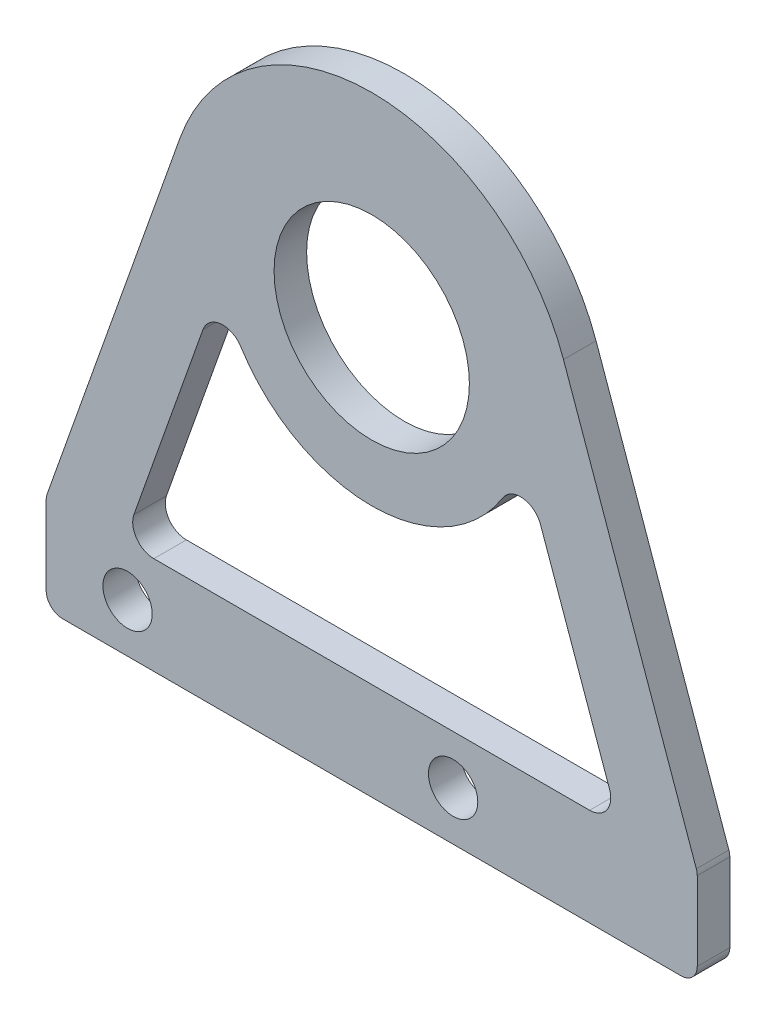
ISO-10303-21;
HEADER;
FILE_DESCRIPTION(('STEP AP214'),'2;1');
FILE_NAME('part.step','',(''),(''),'','','');
FILE_SCHEMA(('AUTOMOTIVE_DESIGN { 1 0 10303 214 1 1 1 1 }'));
ENDSEC;
DATA;
#1=APPLICATION_CONTEXT('core data for automotive mechanical design processes');
#2=APPLICATION_PROTOCOL_DEFINITION('international standard','automotive_design',2000,#1);
#3=PRODUCT_CONTEXT('',#1,'mechanical');
#4=PRODUCT('Part','Part','',(#3));
#5=PRODUCT_RELATED_PRODUCT_CATEGORY('part','',(#4));
#6=PRODUCT_DEFINITION_FORMATION('','',#4);
#7=PRODUCT_DEFINITION_CONTEXT('part definition',#1,'design');
#8=PRODUCT_DEFINITION('design','',#6,#7);
#9=PRODUCT_DEFINITION_SHAPE('','',#8);
#10=(LENGTH_UNIT() NAMED_UNIT(*) SI_UNIT(.MILLI.,.METRE.));
#11=(NAMED_UNIT(*) PLANE_ANGLE_UNIT() SI_UNIT($,.RADIAN.));
#12=(NAMED_UNIT(*) SI_UNIT($,.STERADIAN.) SOLID_ANGLE_UNIT());
#13=UNCERTAINTY_MEASURE_WITH_UNIT(LENGTH_MEASURE(1.E-05),#10,'distance_accuracy_value','');
#14=(GEOMETRIC_REPRESENTATION_CONTEXT(3) GLOBAL_UNCERTAINTY_ASSIGNED_CONTEXT((#13)) GLOBAL_UNIT_ASSIGNED_CONTEXT((#10,
#11,#12)) REPRESENTATION_CONTEXT('',''));
#15=CARTESIAN_POINT('',(0.,0.,0.));
#16=DIRECTION('',(0.,0.,1.));
#17=DIRECTION('',(1.,0.,0.));
#18=AXIS2_PLACEMENT_3D('',#15,#16,#17);
#19=CARTESIAN_POINT('',(0.,0.,2.));
#20=DIRECTION('',(0.,0.,1.));
#21=DIRECTION('',(1.,0.,0.));
#22=AXIS2_PLACEMENT_3D('',#19,#20,#21);
#23=PLANE('',#22);
#24=CARTESIAN_POINT('',(0.,0.,2.));
#25=DIRECTION('',(0.,0.,1.));
#26=DIRECTION('',(1.,0.,0.));
#27=AXIS2_PLACEMENT_3D('',#24,#25,#26);
#28=CIRCLE('',#27,9.5);
#29=CARTESIAN_POINT('',(8.04480674425406,-5.05282935073057,2.));
#30=VERTEX_POINT('',#29);
#31=CARTESIAN_POINT('',(-8.04480674425406,-5.05282935073057,2.));
#32=VERTEX_POINT('',#31);
#33=EDGE_CURVE('E274',#30,#32,#28,.F.);
#34=ORIENTED_EDGE('',*,*,#33,.F.);
#35=CARTESIAN_POINT('',(9.14567503557304,-5.74426915662002,2.));
#36=DIRECTION('',(0.,0.,1.));
#37=DIRECTION('',(1.,0.,0.));
#38=AXIS2_PLACEMENT_3D('',#35,#36,#37);
#39=CIRCLE('',#38,1.3);
#40=CARTESIAN_POINT('',(10.3709235661795,-5.30979701913958,2.));
#41=VERTEX_POINT('',#40);
#42=EDGE_CURVE('E11',#30,#41,#39,.F.);
#43=ORIENTED_EDGE('',*,*,#42,.T.);
#44=DIRECTION('',(-0.334209336523414,0.942498869697243,0.));
#45=VECTOR('',#44,1.);
#46=CARTESIAN_POINT('',(7.53999095757794,2.67367469218731,2.));
#47=LINE('',#46,#45);
#48=CARTESIAN_POINT('',(14.6104160486498,-17.2655278625187,2.));
#49=VERTEX_POINT('',#48);
#50=EDGE_CURVE('E272',#49,#41,#47,.T.);
#51=ORIENTED_EDGE('',*,*,#50,.F.);
#52=CARTESIAN_POINT('',(13.3851675180434,-17.6999999999992,2.));
#53=DIRECTION('',(0.,0.,1.));
#54=DIRECTION('',(1.,0.,0.));
#55=AXIS2_PLACEMENT_3D('',#52,#53,#54);
#56=CIRCLE('',#55,1.3);
#57=CARTESIAN_POINT('',(13.3851675180434,-18.9999999999992,2.));
#58=VERTEX_POINT('',#57);
#59=EDGE_CURVE('E254',#49,#58,#56,.F.);
#60=ORIENTED_EDGE('',*,*,#59,.T.);
#61=DIRECTION('',(1.,0.,0.));
#62=VECTOR('',#61,1.);
#63=CARTESIAN_POINT('',(0.,-18.9999999999992,2.));
#64=LINE('',#63,#62);
#65=CARTESIAN_POINT('',(-13.3851675180434,-18.9999999999992,2.));
#66=VERTEX_POINT('',#65);
#67=EDGE_CURVE('E278',#66,#58,#64,.T.);
#68=ORIENTED_EDGE('',*,*,#67,.F.);
#69=CARTESIAN_POINT('',(-13.3851675180434,-17.6999999999992,2.));
#70=DIRECTION('',(0.,0.,1.));
#71=DIRECTION('',(1.,0.,0.));
#72=AXIS2_PLACEMENT_3D('',#69,#70,#71);
#73=CIRCLE('',#72,1.3);
#74=CARTESIAN_POINT('',(-14.6104160486498,-17.2655278625187,2.));
#75=VERTEX_POINT('',#74);
#76=EDGE_CURVE('E251',#66,#75,#73,.F.);
#77=ORIENTED_EDGE('',*,*,#76,.T.);
#78=DIRECTION('',(-0.334209336523414,-0.942498869697243,0.));
#79=VECTOR('',#78,1.);
#80=CARTESIAN_POINT('',(-7.53999095757793,2.67367469218731,2.));
#81=LINE('',#80,#79);
#82=CARTESIAN_POINT('',(-10.3709235661795,-5.30979701913959,2.));
#83=VERTEX_POINT('',#82);
#84=EDGE_CURVE('E282',#83,#75,#81,.T.);
#85=ORIENTED_EDGE('',*,*,#84,.F.);
#86=CARTESIAN_POINT('',(-9.14567503557304,-5.74426915662002,2.));
#87=DIRECTION('',(0.,0.,1.));
#88=DIRECTION('',(1.,0.,0.));
#89=AXIS2_PLACEMENT_3D('',#86,#87,#88);
#90=CIRCLE('',#89,1.3);
#91=EDGE_CURVE('E247',#83,#32,#90,.F.);
#92=ORIENTED_EDGE('',*,*,#91,.T.);
#93=EDGE_LOOP('',(#34,#43,#51,#60,#68,#77,#85,#92));
#94=FACE_BOUND('',#93,.T.);
#95=CARTESIAN_POINT('',(-14.9999999999999,-21.9999999999991,2.));
#96=DIRECTION('',(0.,0.,1.));
#97=DIRECTION('',(1.,0.,0.));
#98=AXIS2_PLACEMENT_3D('',#95,#96,#97);
#99=CIRCLE('',#98,1.51499999999972);
#100=CARTESIAN_POINT('',(-13.4850000000002,-21.9999999999991,2.));
#101=VERTEX_POINT('',#100);
#102=EDGE_CURVE('E301',#101,#101,#99,.T.);
#103=ORIENTED_EDGE('',*,*,#102,.F.);
#104=EDGE_LOOP('',(#103));
#105=FACE_BOUND('',#104,.T.);
#106=CARTESIAN_POINT('',(5.00000000000007,-21.9999999999992,2.));
#107=DIRECTION('',(0.,0.,1.));
#108=DIRECTION('',(1.,0.,0.));
#109=AXIS2_PLACEMENT_3D('',#106,#107,#108);
#110=CIRCLE('',#109,1.51499999999973);
#111=CARTESIAN_POINT('',(6.5149999999998,-21.9999999999992,2.));
#112=VERTEX_POINT('',#111);
#113=EDGE_CURVE('E296',#112,#112,#110,.T.);
#114=ORIENTED_EDGE('',*,*,#113,.F.);
#115=EDGE_LOOP('',(#114));
#116=FACE_BOUND('',#115,.T.);
#117=DIRECTION('',(0.,-1.,0.));
#118=VECTOR('',#117,1.);
#119=CARTESIAN_POINT('',(-20.,-25.,2.));
#120=LINE('',#119,#118);
#121=CARTESIAN_POINT('',(-20.,-19.1720512386066,2.));
#122=VERTEX_POINT('',#121);
#123=CARTESIAN_POINT('',(-20.,-24.,2.));
#124=VERTEX_POINT('',#123);
#125=EDGE_CURVE('E311',#122,#124,#120,.T.);
#126=ORIENTED_EDGE('',*,*,#125,.T.);
#127=CARTESIAN_POINT('',(-19.,-24.,2.));
#128=DIRECTION('',(0.,0.,1.));
#129=DIRECTION('',(1.,0.,0.));
#130=AXIS2_PLACEMENT_3D('',#127,#128,#129);
#131=CIRCLE('',#130,1.);
#132=CARTESIAN_POINT('',(-19.,-25.,2.));
#133=VERTEX_POINT('',#132);
#134=EDGE_CURVE('E215',#124,#133,#131,.T.);
#135=ORIENTED_EDGE('',*,*,#134,.T.);
#136=DIRECTION('',(1.,0.,0.));
#137=VECTOR('',#136,1.);
#138=CARTESIAN_POINT('',(-20.,-25.,2.));
#139=LINE('',#138,#137);
#140=CARTESIAN_POINT('',(19.,-25.,2.));
#141=VERTEX_POINT('',#140);
#142=EDGE_CURVE('E313',#133,#141,#139,.T.);
#143=ORIENTED_EDGE('',*,*,#142,.T.);
#144=CARTESIAN_POINT('',(19.,-24.,2.));
#145=DIRECTION('',(0.,0.,1.));
#146=DIRECTION('',(1.,0.,0.));
#147=AXIS2_PLACEMENT_3D('',#144,#145,#146);
#148=CIRCLE('',#147,1.);
#149=CARTESIAN_POINT('',(20.,-24.,2.));
#150=VERTEX_POINT('',#149);
#151=EDGE_CURVE('E210',#141,#150,#148,.T.);
#152=ORIENTED_EDGE('',*,*,#151,.T.);
#153=DIRECTION('',(0.,1.,0.));
#154=VECTOR('',#153,1.);
#155=CARTESIAN_POINT('',(20.,-25.,2.));
#156=LINE('',#155,#154);
#157=CARTESIAN_POINT('',(20.,-19.1720512386066,2.));
#158=VERTEX_POINT('',#157);
#159=EDGE_CURVE('E191',#150,#158,#156,.T.);
#160=ORIENTED_EDGE('',*,*,#159,.T.);
#161=CARTESIAN_POINT('',(19.,-19.1720512386066,2.));
#162=DIRECTION('',(0.,0.,1.));
#163=DIRECTION('',(1.,0.,0.));
#164=AXIS2_PLACEMENT_3D('',#161,#162,#163);
#165=CIRCLE('',#164,1.);
#166=CARTESIAN_POINT('',(19.9424988696972,-18.8378419020832,2.));
#167=VERTEX_POINT('',#166);
#168=EDGE_CURVE('E167',#158,#167,#165,.T.);
#169=ORIENTED_EDGE('',*,*,#168,.T.);
#170=DIRECTION('',(-0.334209336523414,0.942498869697242,0.));
#171=VECTOR('',#170,1.);
#172=CARTESIAN_POINT('',(20.,-19.,2.));
#173=LINE('',#172,#171);
#174=CARTESIAN_POINT('',(11.7812358712155,4.17761670654267,2.));
#175=VERTEX_POINT('',#174);
#176=EDGE_CURVE('E158',#167,#175,#173,.T.);
#177=ORIENTED_EDGE('',*,*,#176,.T.);
#178=CARTESIAN_POINT('',(0.,0.,2.));
#179=DIRECTION('',(0.,0.,1.));
#180=DIRECTION('',(1.,0.,0.));
#181=AXIS2_PLACEMENT_3D('',#178,#179,#180);
#182=CIRCLE('',#181,12.5);
#183=CARTESIAN_POINT('',(-11.7812358712155,4.17761670654266,2.));
#184=VERTEX_POINT('',#183);
#185=EDGE_CURVE('E163',#175,#184,#182,.T.);
#186=ORIENTED_EDGE('',*,*,#185,.T.);
#187=DIRECTION('',(-0.334209336523414,-0.942498869697243,0.));
#188=VECTOR('',#187,1.);
#189=CARTESIAN_POINT('',(-20.,-19.,2.));
#190=LINE('',#189,#188);
#191=CARTESIAN_POINT('',(-19.9424988696972,-18.8378419020832,2.));
#192=VERTEX_POINT('',#191);
#193=EDGE_CURVE('E181',#184,#192,#190,.T.);
#194=ORIENTED_EDGE('',*,*,#193,.T.);
#195=CARTESIAN_POINT('',(-19.,-19.1720512386066,2.));
#196=DIRECTION('',(0.,0.,1.));
#197=DIRECTION('',(1.,0.,0.));
#198=AXIS2_PLACEMENT_3D('',#195,#196,#197);
#199=CIRCLE('',#198,1.);
#200=EDGE_CURVE('E213',#192,#122,#199,.T.);
#201=ORIENTED_EDGE('',*,*,#200,.T.);
#202=EDGE_LOOP('',(#126,#135,#143,#152,#160,#169,#177,#186,#194,#201));
#203=FACE_BOUND('',#202,.T.);
#204=CARTESIAN_POINT('',(0.,0.,2.));
#205=DIRECTION('',(0.,0.,1.));
#206=DIRECTION('',(1.,0.,0.));
#207=AXIS2_PLACEMENT_3D('',#204,#205,#206);
#208=CIRCLE('',#207,6.);
#209=CARTESIAN_POINT('',(6.,0.,2.));
#210=VERTEX_POINT('',#209);
#211=EDGE_CURVE('E305',#210,#210,#208,.T.);
#212=ORIENTED_EDGE('',*,*,#211,.F.);
#213=EDGE_LOOP('',(#212));
#214=FACE_BOUND('',#213,.T.);
#215=ADVANCED_FACE('F34',(#94,#105,#116,#203,#214),#23,.T.);
#216=CARTESIAN_POINT('',(0.,0.,0.));
#217=DIRECTION('',(0.,0.,1.));
#218=DIRECTION('',(1.,0.,0.));
#219=AXIS2_PLACEMENT_3D('',#216,#217,#218);
#220=PLANE('',#219);
#221=DIRECTION('',(0.334209336523414,-0.942498869697243,0.));
#222=VECTOR('',#221,1.);
#223=CARTESIAN_POINT('',(9.25230426601766,-2.15519506519281,0.));
#224=LINE('',#223,#222);
#225=CARTESIAN_POINT('',(10.3709235661795,-5.30979701913958,0.));
#226=VERTEX_POINT('',#225);
#227=CARTESIAN_POINT('',(14.6104160486498,-17.2655278625187,0.));
#228=VERTEX_POINT('',#227);
#229=EDGE_CURVE('E260',#226,#228,#224,.T.);
#230=ORIENTED_EDGE('',*,*,#229,.F.);
#231=CARTESIAN_POINT('',(9.14567503557304,-5.74426915662002,0.));
#232=DIRECTION('',(0.,0.,1.));
#233=DIRECTION('',(1.,0.,0.));
#234=AXIS2_PLACEMENT_3D('',#231,#232,#233);
#235=CIRCLE('',#234,1.3);
#236=CARTESIAN_POINT('',(8.04480674425406,-5.05282935073057,0.));
#237=VERTEX_POINT('',#236);
#238=EDGE_CURVE('E42',#226,#237,#235,.T.);
#239=ORIENTED_EDGE('',*,*,#238,.T.);
#240=CARTESIAN_POINT('',(0.,0.,0.));
#241=DIRECTION('',(0.,0.,1.));
#242=DIRECTION('',(-1.,0.,0.));
#243=AXIS2_PLACEMENT_3D('',#240,#241,#242);
#244=CIRCLE('',#243,9.5);
#245=CARTESIAN_POINT('',(-8.04480674425406,-5.05282935073057,0.));
#246=VERTEX_POINT('',#245);
#247=EDGE_CURVE('E259',#246,#237,#244,.T.);
#248=ORIENTED_EDGE('',*,*,#247,.F.);
#249=CARTESIAN_POINT('',(-9.14567503557304,-5.74426915662002,0.));
#250=DIRECTION('',(0.,0.,1.));
#251=DIRECTION('',(1.,0.,0.));
#252=AXIS2_PLACEMENT_3D('',#249,#250,#251);
#253=CIRCLE('',#252,1.3);
#254=CARTESIAN_POINT('',(-10.3709235661795,-5.30979701913958,0.));
#255=VERTEX_POINT('',#254);
#256=EDGE_CURVE('E245',#246,#255,#253,.T.);
#257=ORIENTED_EDGE('',*,*,#256,.T.);
#258=DIRECTION('',(0.334209336523414,0.942498869697243,0.));
#259=VECTOR('',#258,1.);
#260=CARTESIAN_POINT('',(-15.2254584650634,-18.9999999999992,0.));
#261=LINE('',#260,#259);
#262=CARTESIAN_POINT('',(-14.6104160486498,-17.2655278625187,0.));
#263=VERTEX_POINT('',#262);
#264=EDGE_CURVE('E279',#263,#255,#261,.T.);
#265=ORIENTED_EDGE('',*,*,#264,.F.);
#266=CARTESIAN_POINT('',(-13.3851675180434,-17.6999999999992,0.));
#267=DIRECTION('',(0.,0.,1.));
#268=DIRECTION('',(1.,0.,0.));
#269=AXIS2_PLACEMENT_3D('',#266,#267,#268);
#270=CIRCLE('',#269,1.3);
#271=CARTESIAN_POINT('',(-13.3851675180434,-18.9999999999992,0.));
#272=VERTEX_POINT('',#271);
#273=EDGE_CURVE('E249',#263,#272,#270,.T.);
#274=ORIENTED_EDGE('',*,*,#273,.T.);
#275=DIRECTION('',(-1.,0.,0.));
#276=VECTOR('',#275,1.);
#277=CARTESIAN_POINT('',(15.2254584650634,-18.9999999999992,0.));
#278=LINE('',#277,#276);
#279=CARTESIAN_POINT('',(13.3851675180434,-18.9999999999992,0.));
#280=VERTEX_POINT('',#279);
#281=EDGE_CURVE('E285',#280,#272,#278,.T.);
#282=ORIENTED_EDGE('',*,*,#281,.F.);
#283=CARTESIAN_POINT('',(13.3851675180434,-17.6999999999992,0.));
#284=DIRECTION('',(0.,0.,1.));
#285=DIRECTION('',(1.,0.,0.));
#286=AXIS2_PLACEMENT_3D('',#283,#284,#285);
#287=CIRCLE('',#286,1.3);
#288=EDGE_CURVE('E49',#280,#228,#287,.T.);
#289=ORIENTED_EDGE('',*,*,#288,.T.);
#290=EDGE_LOOP('',(#230,#239,#248,#257,#265,#274,#282,#289));
#291=FACE_BOUND('',#290,.T.);
#292=CARTESIAN_POINT('',(-14.9999999999999,-21.9999999999991,0.));
#293=DIRECTION('',(0.,0.,-1.));
#294=DIRECTION('',(-1.,0.,0.));
#295=AXIS2_PLACEMENT_3D('',#292,#293,#294);
#296=CIRCLE('',#295,1.51499999999972);
#297=CARTESIAN_POINT('',(-16.5149999999996,-21.9999999999991,0.));
#298=VERTEX_POINT('',#297);
#299=EDGE_CURVE('E293',#298,#298,#296,.T.);
#300=ORIENTED_EDGE('',*,*,#299,.F.);
#301=EDGE_LOOP('',(#300));
#302=FACE_BOUND('',#301,.T.);
#303=CARTESIAN_POINT('',(5.00000000000007,-21.9999999999992,0.));
#304=DIRECTION('',(0.,0.,-1.));
#305=DIRECTION('',(-1.,0.,0.));
#306=AXIS2_PLACEMENT_3D('',#303,#304,#305);
#307=CIRCLE('',#306,1.51499999999973);
#308=CARTESIAN_POINT('',(3.48500000000033,-21.9999999999992,0.));
#309=VERTEX_POINT('',#308);
#310=EDGE_CURVE('E292',#309,#309,#307,.T.);
#311=ORIENTED_EDGE('',*,*,#310,.F.);
#312=EDGE_LOOP('',(#311));
#313=FACE_BOUND('',#312,.T.);
#314=DIRECTION('',(1.,0.,0.));
#315=VECTOR('',#314,1.);
#316=CARTESIAN_POINT('',(-20.,-25.,0.));
#317=LINE('',#316,#315);
#318=CARTESIAN_POINT('',(-19.,-25.,0.));
#319=VERTEX_POINT('',#318);
#320=CARTESIAN_POINT('',(19.,-25.,0.));
#321=VERTEX_POINT('',#320);
#322=EDGE_CURVE('E326',#319,#321,#317,.T.);
#323=ORIENTED_EDGE('',*,*,#322,.F.);
#324=CARTESIAN_POINT('',(-19.,-24.,0.));
#325=DIRECTION('',(0.,0.,1.));
#326=DIRECTION('',(1.,0.,0.));
#327=AXIS2_PLACEMENT_3D('',#324,#325,#326);
#328=CIRCLE('',#327,1.);
#329=CARTESIAN_POINT('',(-20.,-24.,0.));
#330=VERTEX_POINT('',#329);
#331=EDGE_CURVE('E203',#319,#330,#328,.F.);
#332=ORIENTED_EDGE('',*,*,#331,.T.);
#333=DIRECTION('',(0.,-1.,0.));
#334=VECTOR('',#333,1.);
#335=CARTESIAN_POINT('',(-20.,-25.,0.));
#336=LINE('',#335,#334);
#337=CARTESIAN_POINT('',(-20.,-19.1720512386066,0.));
#338=VERTEX_POINT('',#337);
#339=EDGE_CURVE('E323',#338,#330,#336,.T.);
#340=ORIENTED_EDGE('',*,*,#339,.F.);
#341=CARTESIAN_POINT('',(-19.,-19.1720512386066,0.));
#342=DIRECTION('',(0.,0.,1.));
#343=DIRECTION('',(1.,0.,0.));
#344=AXIS2_PLACEMENT_3D('',#341,#342,#343);
#345=CIRCLE('',#344,1.);
#346=CARTESIAN_POINT('',(-19.9424988696972,-18.8378419020832,0.));
#347=VERTEX_POINT('',#346);
#348=EDGE_CURVE('E201',#338,#347,#345,.F.);
#349=ORIENTED_EDGE('',*,*,#348,.T.);
#350=DIRECTION('',(-0.334209336523414,-0.942498869697243,0.));
#351=VECTOR('',#350,1.);
#352=CARTESIAN_POINT('',(-20.,-19.,0.));
#353=LINE('',#352,#351);
#354=CARTESIAN_POINT('',(-11.7812358712155,4.17761670654266,0.));
#355=VERTEX_POINT('',#354);
#356=EDGE_CURVE('E320',#355,#347,#353,.T.);
#357=ORIENTED_EDGE('',*,*,#356,.F.);
#358=CARTESIAN_POINT('',(0.,0.,0.));
#359=DIRECTION('',(0.,0.,1.));
#360=DIRECTION('',(1.,0.,0.));
#361=AXIS2_PLACEMENT_3D('',#358,#359,#360);
#362=CIRCLE('',#361,12.5);
#363=CARTESIAN_POINT('',(11.7812358712155,4.17761670654267,0.));
#364=VERTEX_POINT('',#363);
#365=EDGE_CURVE('E318',#364,#355,#362,.T.);
#366=ORIENTED_EDGE('',*,*,#365,.F.);
#367=DIRECTION('',(-0.334209336523414,0.942498869697242,0.));
#368=VECTOR('',#367,1.);
#369=CARTESIAN_POINT('',(20.,-19.,0.));
#370=LINE('',#369,#368);
#371=CARTESIAN_POINT('',(19.9424988696972,-18.8378419020832,0.));
#372=VERTEX_POINT('',#371);
#373=EDGE_CURVE('E185',#372,#364,#370,.T.);
#374=ORIENTED_EDGE('',*,*,#373,.F.);
#375=CARTESIAN_POINT('',(19.,-19.1720512386066,0.));
#376=DIRECTION('',(0.,0.,1.));
#377=DIRECTION('',(1.,0.,0.));
#378=AXIS2_PLACEMENT_3D('',#375,#376,#377);
#379=CIRCLE('',#378,1.);
#380=CARTESIAN_POINT('',(20.,-19.1720512386066,0.));
#381=VERTEX_POINT('',#380);
#382=EDGE_CURVE('E199',#372,#381,#379,.F.);
#383=ORIENTED_EDGE('',*,*,#382,.T.);
#384=DIRECTION('',(0.,1.,0.));
#385=VECTOR('',#384,1.);
#386=CARTESIAN_POINT('',(20.,-25.,0.));
#387=LINE('',#386,#385);
#388=CARTESIAN_POINT('',(20.,-24.,0.));
#389=VERTEX_POINT('',#388);
#390=EDGE_CURVE('E172',#389,#381,#387,.T.);
#391=ORIENTED_EDGE('',*,*,#390,.F.);
#392=CARTESIAN_POINT('',(19.,-24.,0.));
#393=DIRECTION('',(0.,0.,1.));
#394=DIRECTION('',(1.,0.,0.));
#395=AXIS2_PLACEMENT_3D('',#392,#393,#394);
#396=CIRCLE('',#395,1.);
#397=EDGE_CURVE('E197',#389,#321,#396,.F.);
#398=ORIENTED_EDGE('',*,*,#397,.T.);
#399=EDGE_LOOP('',(#323,#332,#340,#349,#357,#366,#374,#383,#391,#398));
#400=FACE_BOUND('',#399,.T.);
#401=CARTESIAN_POINT('',(0.,0.,0.));
#402=DIRECTION('',(0.,0.,1.));
#403=DIRECTION('',(1.,0.,0.));
#404=AXIS2_PLACEMENT_3D('',#401,#402,#403);
#405=CIRCLE('',#404,6.);
#406=CARTESIAN_POINT('',(6.,0.,0.));
#407=VERTEX_POINT('',#406);
#408=EDGE_CURVE('E304',#407,#407,#405,.T.);
#409=ORIENTED_EDGE('',*,*,#408,.T.);
#410=EDGE_LOOP('',(#409));
#411=FACE_BOUND('',#410,.T.);
#412=ADVANCED_FACE('F257',(#291,#302,#313,#400,#411),#220,.F.);
#413=CARTESIAN_POINT('',(20.,-19.,2.));
#414=DIRECTION('',(-0.942498869697242,-0.334209336523414,0.));
#415=DIRECTION('',(0.334209336523414,-0.942498869697242,0.));
#416=AXIS2_PLACEMENT_3D('',#413,#414,#415);
#417=PLANE('',#416);
#418=ORIENTED_EDGE('',*,*,#176,.F.);
#419=DIRECTION('',(0.,0.,-1.));
#420=VECTOR('',#419,1.);
#421=CARTESIAN_POINT('',(19.9424988696972,-18.8378419020832,2.));
#422=LINE('',#421,#420);
#423=EDGE_CURVE('E219',#167,#372,#422,.T.);
#424=ORIENTED_EDGE('',*,*,#423,.T.);
#425=ORIENTED_EDGE('',*,*,#373,.T.);
#426=DIRECTION('',(0.,0.,-1.));
#427=VECTOR('',#426,1.);
#428=CARTESIAN_POINT('',(11.7812358712155,4.17761670654267,2.));
#429=LINE('',#428,#427);
#430=EDGE_CURVE('E177',#175,#364,#429,.T.);
#431=ORIENTED_EDGE('',*,*,#430,.F.);
#432=EDGE_LOOP('',(#418,#424,#425,#431));
#433=FACE_BOUND('',#432,.T.);
#434=ADVANCED_FACE('F183',(#433),#417,.F.);
#435=CARTESIAN_POINT('',(0.,0.,2.));
#436=DIRECTION('',(0.,0.,-1.));
#437=DIRECTION('',(-1.,0.,0.));
#438=AXIS2_PLACEMENT_3D('',#435,#436,#437);
#439=CYLINDRICAL_SURFACE('',#438,12.5);
#440=ORIENTED_EDGE('',*,*,#365,.T.);
#441=DIRECTION('',(0.,0.,-1.));
#442=VECTOR('',#441,1.);
#443=CARTESIAN_POINT('',(-11.7812358712155,4.17761670654266,2.));
#444=LINE('',#443,#442);
#445=EDGE_CURVE('E179',#184,#355,#444,.T.);
#446=ORIENTED_EDGE('',*,*,#445,.F.);
#447=ORIENTED_EDGE('',*,*,#185,.F.);
#448=ORIENTED_EDGE('',*,*,#430,.T.);
#449=EDGE_LOOP('',(#440,#446,#447,#448));
#450=FACE_BOUND('',#449,.T.);
#451=ADVANCED_FACE('F176',(#450),#439,.T.);
#452=CARTESIAN_POINT('',(-20.,-19.,2.));
#453=DIRECTION('',(0.942498869697243,-0.334209336523414,0.));
#454=DIRECTION('',(0.334209336523414,0.942498869697243,0.));
#455=AXIS2_PLACEMENT_3D('',#452,#453,#454);
#456=PLANE('',#455);
#457=ORIENTED_EDGE('',*,*,#356,.T.);
#458=DIRECTION('',(0.,0.,-1.));
#459=VECTOR('',#458,1.);
#460=CARTESIAN_POINT('',(-19.9424988696972,-18.8378419020832,2.));
#461=LINE('',#460,#459);
#462=EDGE_CURVE('E217',#347,#192,#461,.F.);
#463=ORIENTED_EDGE('',*,*,#462,.T.);
#464=ORIENTED_EDGE('',*,*,#193,.F.);
#465=ORIENTED_EDGE('',*,*,#445,.T.);
#466=EDGE_LOOP('',(#457,#463,#464,#465));
#467=FACE_BOUND('',#466,.T.);
#468=ADVANCED_FACE('F342',(#467),#456,.F.);
#469=CARTESIAN_POINT('',(-20.,-25.,2.));
#470=DIRECTION('',(1.,0.,0.));
#471=DIRECTION('',(0.,0.,-1.));
#472=AXIS2_PLACEMENT_3D('',#469,#470,#471);
#473=PLANE('',#472);
#474=ORIENTED_EDGE('',*,*,#339,.T.);
#475=DIRECTION('',(0.,0.,-1.));
#476=VECTOR('',#475,1.);
#477=CARTESIAN_POINT('',(-20.,-24.,2.));
#478=LINE('',#477,#476);
#479=EDGE_CURVE('E208',#330,#124,#478,.F.);
#480=ORIENTED_EDGE('',*,*,#479,.T.);
#481=ORIENTED_EDGE('',*,*,#125,.F.);
#482=DIRECTION('',(0.,0.,-1.));
#483=VECTOR('',#482,1.);
#484=CARTESIAN_POINT('',(-20.,-19.1720512386066,2.));
#485=LINE('',#484,#483);
#486=EDGE_CURVE('E205',#122,#338,#485,.T.);
#487=ORIENTED_EDGE('',*,*,#486,.T.);
#488=EDGE_LOOP('',(#474,#480,#481,#487));
#489=FACE_BOUND('',#488,.T.);
#490=ADVANCED_FACE('F351',(#489),#473,.F.);
#491=CARTESIAN_POINT('',(-20.,-25.,2.));
#492=DIRECTION('',(0.,1.,0.));
#493=DIRECTION('',(-1.,0.,0.));
#494=AXIS2_PLACEMENT_3D('',#491,#492,#493);
#495=PLANE('',#494);
#496=ORIENTED_EDGE('',*,*,#142,.F.);
#497=DIRECTION('',(0.,0.,-1.));
#498=VECTOR('',#497,1.);
#499=CARTESIAN_POINT('',(-19.,-25.,2.));
#500=LINE('',#499,#498);
#501=EDGE_CURVE('E189',#133,#319,#500,.T.);
#502=ORIENTED_EDGE('',*,*,#501,.T.);
#503=ORIENTED_EDGE('',*,*,#322,.T.);
#504=DIRECTION('',(0.,0.,-1.));
#505=VECTOR('',#504,1.);
#506=CARTESIAN_POINT('',(19.,-25.,2.));
#507=LINE('',#506,#505);
#508=EDGE_CURVE('E187',#321,#141,#507,.F.);
#509=ORIENTED_EDGE('',*,*,#508,.T.);
#510=EDGE_LOOP('',(#496,#502,#503,#509));
#511=FACE_BOUND('',#510,.T.);
#512=ADVANCED_FACE('F359',(#511),#495,.F.);
#513=CARTESIAN_POINT('',(20.,-25.,2.));
#514=DIRECTION('',(-1.,0.,0.));
#515=DIRECTION('',(0.,0.,1.));
#516=AXIS2_PLACEMENT_3D('',#513,#514,#515);
#517=PLANE('',#516);
#518=ORIENTED_EDGE('',*,*,#390,.T.);
#519=DIRECTION('',(0.,0.,-1.));
#520=VECTOR('',#519,1.);
#521=CARTESIAN_POINT('',(20.,-19.1720512386066,2.));
#522=LINE('',#521,#520);
#523=EDGE_CURVE('E224',#381,#158,#522,.F.);
#524=ORIENTED_EDGE('',*,*,#523,.T.);
#525=ORIENTED_EDGE('',*,*,#159,.F.);
#526=DIRECTION('',(0.,0.,-1.));
#527=VECTOR('',#526,1.);
#528=CARTESIAN_POINT('',(20.,-24.,2.));
#529=LINE('',#528,#527);
#530=EDGE_CURVE('E221',#150,#389,#529,.T.);
#531=ORIENTED_EDGE('',*,*,#530,.T.);
#532=EDGE_LOOP('',(#518,#524,#525,#531));
#533=FACE_BOUND('',#532,.T.);
#534=ADVANCED_FACE('F332',(#533),#517,.F.);
#535=CARTESIAN_POINT('',(0.,0.,2.));
#536=DIRECTION('',(0.,0.,-1.));
#537=DIRECTION('',(-1.,0.,0.));
#538=AXIS2_PLACEMENT_3D('',#535,#536,#537);
#539=CYLINDRICAL_SURFACE('',#538,6.);
#540=ORIENTED_EDGE('',*,*,#211,.T.);
#541=EDGE_LOOP('',(#540));
#542=FACE_BOUND('',#541,.T.);
#543=ORIENTED_EDGE('',*,*,#408,.F.);
#544=EDGE_LOOP('',(#543));
#545=FACE_BOUND('',#544,.T.);
#546=ADVANCED_FACE('F383',(#542,#545),#539,.F.);
#547=CARTESIAN_POINT('',(-19.,-24.,2.));
#548=DIRECTION('',(0.,0.,-1.));
#549=DIRECTION('',(-1.,0.,0.));
#550=AXIS2_PLACEMENT_3D('',#547,#548,#549);
#551=CYLINDRICAL_SURFACE('',#550,1.);
#552=ORIENTED_EDGE('',*,*,#134,.F.);
#553=ORIENTED_EDGE('',*,*,#479,.F.);
#554=ORIENTED_EDGE('',*,*,#331,.F.);
#555=ORIENTED_EDGE('',*,*,#501,.F.);
#556=EDGE_LOOP('',(#552,#553,#554,#555));
#557=FACE_BOUND('',#556,.T.);
#558=ADVANCED_FACE('F356',(#557),#551,.T.);
#559=CARTESIAN_POINT('',(-19.,-19.1720512386066,2.));
#560=DIRECTION('',(0.,0.,-1.));
#561=DIRECTION('',(-1.,0.,0.));
#562=AXIS2_PLACEMENT_3D('',#559,#560,#561);
#563=CYLINDRICAL_SURFACE('',#562,1.);
#564=ORIENTED_EDGE('',*,*,#200,.F.);
#565=ORIENTED_EDGE('',*,*,#462,.F.);
#566=ORIENTED_EDGE('',*,*,#348,.F.);
#567=ORIENTED_EDGE('',*,*,#486,.F.);
#568=EDGE_LOOP('',(#564,#565,#566,#567));
#569=FACE_BOUND('',#568,.T.);
#570=ADVANCED_FACE('F348',(#569),#563,.T.);
#571=CARTESIAN_POINT('',(19.,-19.1720512386066,2.));
#572=DIRECTION('',(0.,0.,-1.));
#573=DIRECTION('',(-1.,0.,0.));
#574=AXIS2_PLACEMENT_3D('',#571,#572,#573);
#575=CYLINDRICAL_SURFACE('',#574,1.);
#576=ORIENTED_EDGE('',*,*,#168,.F.);
#577=ORIENTED_EDGE('',*,*,#523,.F.);
#578=ORIENTED_EDGE('',*,*,#382,.F.);
#579=ORIENTED_EDGE('',*,*,#423,.F.);
#580=EDGE_LOOP('',(#576,#577,#578,#579));
#581=FACE_BOUND('',#580,.T.);
#582=ADVANCED_FACE('F337',(#581),#575,.T.);
#583=CARTESIAN_POINT('',(19.,-24.,2.));
#584=DIRECTION('',(0.,0.,-1.));
#585=DIRECTION('',(-1.,0.,0.));
#586=AXIS2_PLACEMENT_3D('',#583,#584,#585);
#587=CYLINDRICAL_SURFACE('',#586,1.);
#588=ORIENTED_EDGE('',*,*,#151,.F.);
#589=ORIENTED_EDGE('',*,*,#508,.F.);
#590=ORIENTED_EDGE('',*,*,#397,.F.);
#591=ORIENTED_EDGE('',*,*,#530,.F.);
#592=EDGE_LOOP('',(#588,#589,#590,#591));
#593=FACE_BOUND('',#592,.T.);
#594=ADVANCED_FACE('F363',(#593),#587,.T.);
#595=CARTESIAN_POINT('',(5.00000000000007,-21.9999999999992,10.));
#596=DIRECTION('',(0.,0.,-1.));
#597=DIRECTION('',(-1.,0.,0.));
#598=AXIS2_PLACEMENT_3D('',#595,#596,#597);
#599=CYLINDRICAL_SURFACE('',#598,1.51499999999973);
#600=ORIENTED_EDGE('',*,*,#113,.T.);
#601=EDGE_LOOP('',(#600));
#602=FACE_BOUND('',#601,.T.);
#603=ORIENTED_EDGE('',*,*,#310,.T.);
#604=EDGE_LOOP('',(#603));
#605=FACE_BOUND('',#604,.T.);
#606=ADVANCED_FACE('F365',(#602,#605),#599,.F.);
#607=CARTESIAN_POINT('',(-14.9999999999999,-21.9999999999991,10.));
#608=DIRECTION('',(0.,0.,-1.));
#609=DIRECTION('',(-1.,0.,0.));
#610=AXIS2_PLACEMENT_3D('',#607,#608,#609);
#611=CYLINDRICAL_SURFACE('',#610,1.51499999999972);
#612=ORIENTED_EDGE('',*,*,#102,.T.);
#613=EDGE_LOOP('',(#612));
#614=FACE_BOUND('',#613,.T.);
#615=ORIENTED_EDGE('',*,*,#299,.T.);
#616=EDGE_LOOP('',(#615));
#617=FACE_BOUND('',#616,.T.);
#618=ADVANCED_FACE('F371',(#614,#617),#611,.F.);
#619=CARTESIAN_POINT('',(0.,0.,10.));
#620=DIRECTION('',(0.,0.,-1.));
#621=DIRECTION('',(-1.,0.,0.));
#622=AXIS2_PLACEMENT_3D('',#619,#620,#621);
#623=CYLINDRICAL_SURFACE('',#622,9.5);
#624=ORIENTED_EDGE('',*,*,#33,.T.);
#625=DIRECTION('',(0.,0.,-1.));
#626=VECTOR('',#625,1.);
#627=CARTESIAN_POINT('',(-8.04480674425406,-5.05282935073057,10.));
#628=LINE('',#627,#626);
#629=EDGE_CURVE('E228',#32,#246,#628,.T.);
#630=ORIENTED_EDGE('',*,*,#629,.T.);
#631=ORIENTED_EDGE('',*,*,#247,.T.);
#632=DIRECTION('',(0.,0.,-1.));
#633=VECTOR('',#632,1.);
#634=CARTESIAN_POINT('',(8.04480674425406,-5.05282935073057,10.));
#635=LINE('',#634,#633);
#636=EDGE_CURVE('E226',#237,#30,#635,.F.);
#637=ORIENTED_EDGE('',*,*,#636,.T.);
#638=EDGE_LOOP('',(#624,#630,#631,#637));
#639=FACE_BOUND('',#638,.T.);
#640=ADVANCED_FACE('F263',(#639),#623,.T.);
#641=CARTESIAN_POINT('',(-15.2254584650634,-18.9999999999992,10.));
#642=DIRECTION('',(-0.942498869697243,0.334209336523414,0.));
#643=DIRECTION('',(-0.334209336523414,-0.942498869697243,0.));
#644=AXIS2_PLACEMENT_3D('',#641,#642,#643);
#645=PLANE('',#644);
#646=ORIENTED_EDGE('',*,*,#264,.T.);
#647=DIRECTION('',(0.,0.,1.));
#648=VECTOR('',#647,1.);
#649=CARTESIAN_POINT('',(-10.3709235661795,-5.30979701913958,2.));
#650=LINE('',#649,#648);
#651=EDGE_CURVE('E234',#255,#83,#650,.T.);
#652=ORIENTED_EDGE('',*,*,#651,.T.);
#653=ORIENTED_EDGE('',*,*,#84,.T.);
#654=DIRECTION('',(0.,0.,-1.));
#655=VECTOR('',#654,1.);
#656=CARTESIAN_POINT('',(-14.6104160486498,-17.2655278625187,0.));
#657=LINE('',#656,#655);
#658=EDGE_CURVE('E231',#75,#263,#657,.T.);
#659=ORIENTED_EDGE('',*,*,#658,.T.);
#660=EDGE_LOOP('',(#646,#652,#653,#659));
#661=FACE_BOUND('',#660,.T.);
#662=ADVANCED_FACE('F448',(#661),#645,.F.);
#663=CARTESIAN_POINT('',(15.2254584650634,-18.9999999999992,10.));
#664=DIRECTION('',(0.,-1.,0.));
#665=DIRECTION('',(0.,0.,-1.));
#666=AXIS2_PLACEMENT_3D('',#663,#664,#665);
#667=PLANE('',#666);
#668=ORIENTED_EDGE('',*,*,#281,.T.);
#669=DIRECTION('',(0.,0.,-1.));
#670=VECTOR('',#669,1.);
#671=CARTESIAN_POINT('',(-13.3851675180434,-18.9999999999992,2.));
#672=LINE('',#671,#670);
#673=EDGE_CURVE('E239',#272,#66,#672,.F.);
#674=ORIENTED_EDGE('',*,*,#673,.T.);
#675=ORIENTED_EDGE('',*,*,#67,.T.);
#676=DIRECTION('',(0.,0.,-1.));
#677=VECTOR('',#676,1.);
#678=CARTESIAN_POINT('',(13.3851675180434,-18.9999999999992,0.));
#679=LINE('',#678,#677);
#680=EDGE_CURVE('E236',#58,#280,#679,.T.);
#681=ORIENTED_EDGE('',*,*,#680,.T.);
#682=EDGE_LOOP('',(#668,#674,#675,#681));
#683=FACE_BOUND('',#682,.T.);
#684=ADVANCED_FACE('F457',(#683),#667,.F.);
#685=CARTESIAN_POINT('',(9.25230426601766,-2.15519506519281,10.));
#686=DIRECTION('',(0.942498869697243,0.334209336523414,0.));
#687=DIRECTION('',(-0.334209336523414,0.942498869697243,0.));
#688=AXIS2_PLACEMENT_3D('',#685,#686,#687);
#689=PLANE('',#688);
#690=ORIENTED_EDGE('',*,*,#229,.T.);
#691=DIRECTION('',(0.,0.,-1.));
#692=VECTOR('',#691,1.);
#693=CARTESIAN_POINT('',(14.6104160486498,-17.2655278625187,2.));
#694=LINE('',#693,#692);
#695=EDGE_CURVE('E243',#228,#49,#694,.F.);
#696=ORIENTED_EDGE('',*,*,#695,.T.);
#697=ORIENTED_EDGE('',*,*,#50,.T.);
#698=DIRECTION('',(0.,0.,1.));
#699=VECTOR('',#698,1.);
#700=CARTESIAN_POINT('',(10.3709235661795,-5.30979701913958,0.));
#701=LINE('',#700,#699);
#702=EDGE_CURVE('E241',#41,#226,#701,.F.);
#703=ORIENTED_EDGE('',*,*,#702,.T.);
#704=EDGE_LOOP('',(#690,#696,#697,#703));
#705=FACE_BOUND('',#704,.T.);
#706=ADVANCED_FACE('F276',(#705),#689,.F.);
#707=CARTESIAN_POINT('',(-9.14567503557304,-5.74426915662002,10.));
#708=DIRECTION('',(0.,0.,-1.));
#709=DIRECTION('',(-1.,0.,0.));
#710=AXIS2_PLACEMENT_3D('',#707,#708,#709);
#711=CYLINDRICAL_SURFACE('',#710,1.3);
#712=ORIENTED_EDGE('',*,*,#91,.F.);
#713=ORIENTED_EDGE('',*,*,#651,.F.);
#714=ORIENTED_EDGE('',*,*,#256,.F.);
#715=ORIENTED_EDGE('',*,*,#629,.F.);
#716=EDGE_LOOP('',(#712,#713,#714,#715));
#717=FACE_BOUND('',#716,.T.);
#718=ADVANCED_FACE('F476',(#717),#711,.F.);
#719=CARTESIAN_POINT('',(-13.3851675180434,-17.6999999999992,10.));
#720=DIRECTION('',(0.,0.,1.));
#721=DIRECTION('',(1.,0.,0.));
#722=AXIS2_PLACEMENT_3D('',#719,#720,#721);
#723=CYLINDRICAL_SURFACE('',#722,1.3);
#724=ORIENTED_EDGE('',*,*,#76,.F.);
#725=ORIENTED_EDGE('',*,*,#673,.F.);
#726=ORIENTED_EDGE('',*,*,#273,.F.);
#727=ORIENTED_EDGE('',*,*,#658,.F.);
#728=EDGE_LOOP('',(#724,#725,#726,#727));
#729=FACE_BOUND('',#728,.T.);
#730=ADVANCED_FACE('F485',(#729),#723,.F.);
#731=CARTESIAN_POINT('',(13.3851675180434,-17.6999999999992,10.));
#732=DIRECTION('',(0.,0.,1.));
#733=DIRECTION('',(1.,0.,0.));
#734=AXIS2_PLACEMENT_3D('',#731,#732,#733);
#735=CYLINDRICAL_SURFACE('',#734,1.3);
#736=ORIENTED_EDGE('',*,*,#59,.F.);
#737=ORIENTED_EDGE('',*,*,#695,.F.);
#738=ORIENTED_EDGE('',*,*,#288,.F.);
#739=ORIENTED_EDGE('',*,*,#680,.F.);
#740=EDGE_LOOP('',(#736,#737,#738,#739));
#741=FACE_BOUND('',#740,.T.);
#742=ADVANCED_FACE('F494',(#741),#735,.F.);
#743=CARTESIAN_POINT('',(9.14567503557304,-5.74426915662002,10.));
#744=DIRECTION('',(0.,0.,-1.));
#745=DIRECTION('',(-1.,0.,0.));
#746=AXIS2_PLACEMENT_3D('',#743,#744,#745);
#747=CYLINDRICAL_SURFACE('',#746,1.3);
#748=ORIENTED_EDGE('',*,*,#42,.F.);
#749=ORIENTED_EDGE('',*,*,#636,.F.);
#750=ORIENTED_EDGE('',*,*,#238,.F.);
#751=ORIENTED_EDGE('',*,*,#702,.F.);
#752=EDGE_LOOP('',(#748,#749,#750,#751));
#753=FACE_BOUND('',#752,.T.);
#754=ADVANCED_FACE('F36',(#753),#747,.F.);
#755=CLOSED_SHELL('',(#215,#412,#434,#451,#468,#490,#512,#534,#546,#558,#570,#582,#594,#606,
#618,#640,#662,#684,#706,#718,#730,#742,#754));
#756=MANIFOLD_SOLID_BREP('B2',#755);
#757=ADVANCED_BREP_SHAPE_REPRESENTATION('',(#18,#756),#14);
#758=SHAPE_DEFINITION_REPRESENTATION(#9,#757);
ENDSEC;
END-ISO-10303-21;
